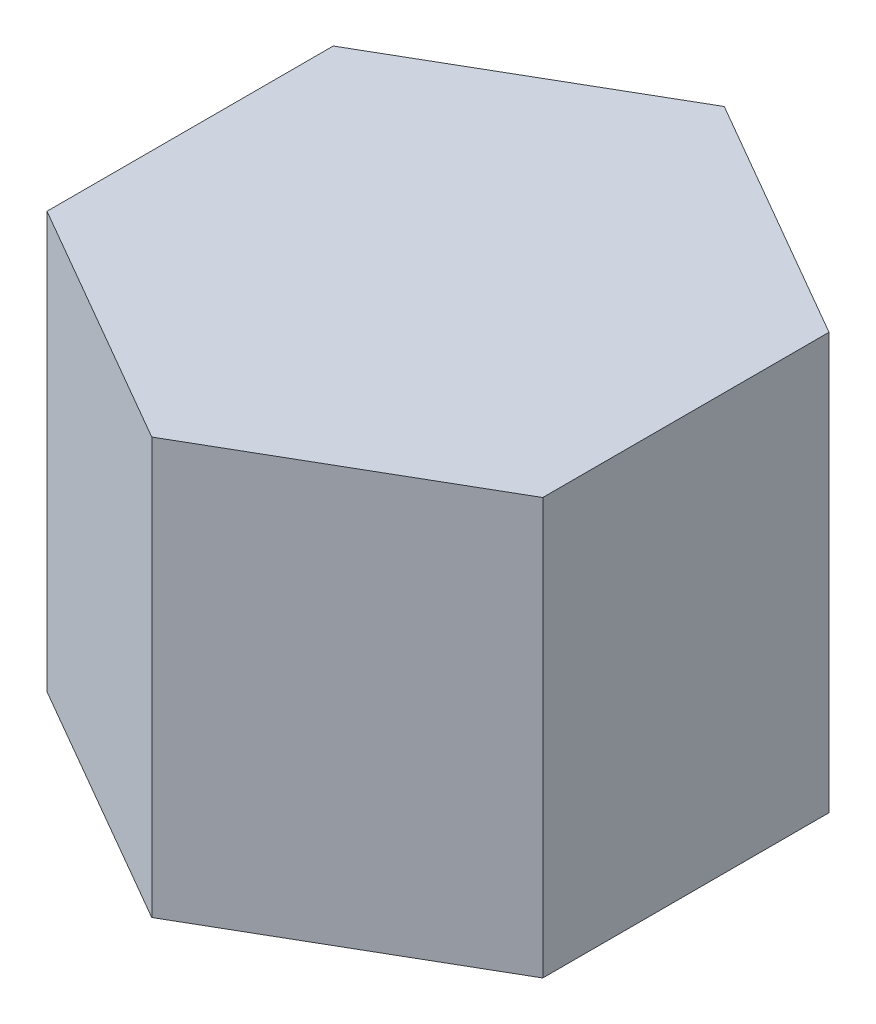
ISO-10303-21;
HEADER;
FILE_DESCRIPTION(('STEP AP214'),'2;1');
FILE_NAME('part.step','',(''),(''),'','','');
FILE_SCHEMA(('AUTOMOTIVE_DESIGN { 1 0 10303 214 1 1 1 1 }'));
ENDSEC;
DATA;
#1=APPLICATION_CONTEXT('core data for automotive mechanical design processes');
#2=APPLICATION_PROTOCOL_DEFINITION('international standard','automotive_design',2000,#1);
#3=PRODUCT_CONTEXT('',#1,'mechanical');
#4=PRODUCT('Part','Part','',(#3));
#5=PRODUCT_RELATED_PRODUCT_CATEGORY('part','',(#4));
#6=PRODUCT_DEFINITION_FORMATION('','',#4);
#7=PRODUCT_DEFINITION_CONTEXT('part definition',#1,'design');
#8=PRODUCT_DEFINITION('design','',#6,#7);
#9=PRODUCT_DEFINITION_SHAPE('','',#8);
#10=(LENGTH_UNIT() NAMED_UNIT(*) SI_UNIT(.MILLI.,.METRE.));
#11=(NAMED_UNIT(*) PLANE_ANGLE_UNIT() SI_UNIT($,.RADIAN.));
#12=(NAMED_UNIT(*) SI_UNIT($,.STERADIAN.) SOLID_ANGLE_UNIT());
#13=UNCERTAINTY_MEASURE_WITH_UNIT(LENGTH_MEASURE(1.E-05),#10,'distance_accuracy_value','');
#14=(GEOMETRIC_REPRESENTATION_CONTEXT(3) GLOBAL_UNCERTAINTY_ASSIGNED_CONTEXT((#13)) GLOBAL_UNIT_ASSIGNED_CONTEXT((#10,
#11,#12)) REPRESENTATION_CONTEXT('',''));
#15=CARTESIAN_POINT('',(0.,0.,0.));
#16=DIRECTION('',(0.,0.,1.));
#17=DIRECTION('',(1.,0.,0.));
#18=AXIS2_PLACEMENT_3D('',#15,#16,#17);
#19=CARTESIAN_POINT('',(208.339551417382,-147.556598747966,293.414022028063));
#20=DIRECTION('',(-0.500000000000028,0.,-0.866025403784422));
#21=DIRECTION('',(-0.866025403784423,0.,0.500000000000028));
#22=AXIS2_PLACEMENT_3D('',#19,#20,#21);
#23=PLANE('',#22);
#24=CARTESIAN_POINT('',(208.642660308706,-147.047793579175,293.239022028063));
#25=DIRECTION('',(-0.866025403784422,0.,0.500000000000028));
#26=VECTOR('',#25,1.);
#27=LINE('',#24,#26);
#28=CARTESIAN_POINT('',(208.642660308706,-147.047793579175,293.239022028063));
#29=VERTEX_POINT('',#28);
#30=CARTESIAN_POINT('',(208.339551417382,-147.047793579175,293.414022028063));
#31=VERTEX_POINT('',#30);
#32=EDGE_CURVE('E170',#29,#31,#27,.T.);
#33=ORIENTED_EDGE('',*,*,#32,.T.);
#34=CARTESIAN_POINT('',(208.339551417382,-147.556598747966,293.414022028063));
#35=DIRECTION('',(0.,1.,0.));
#36=VECTOR('',#35,1.);
#37=LINE('',#34,#36);
#38=CARTESIAN_POINT('',(208.339551417382,-147.556598747966,293.414022028063));
#39=VERTEX_POINT('',#38);
#40=EDGE_CURVE('E35',#39,#31,#37,.T.);
#41=ORIENTED_EDGE('',*,*,#40,.F.);
#42=CARTESIAN_POINT('',(208.642660308706,-147.556598747966,293.239022028063));
#43=DIRECTION('',(-0.866025403784422,0.,0.500000000000028));
#44=VECTOR('',#43,1.);
#45=LINE('',#42,#44);
#46=CARTESIAN_POINT('',(208.642660308706,-147.556598747966,293.239022028063));
#47=VERTEX_POINT('',#46);
#48=EDGE_CURVE('E159',#47,#39,#45,.T.);
#49=ORIENTED_EDGE('',*,*,#48,.F.);
#50=CARTESIAN_POINT('',(208.642660308706,-147.556598747966,293.239022028063));
#51=DIRECTION('',(0.,1.,0.));
#52=VECTOR('',#51,1.);
#53=LINE('',#50,#52);
#54=EDGE_CURVE('E10',#47,#29,#53,.T.);
#55=ORIENTED_EDGE('',*,*,#54,.T.);
#56=EDGE_LOOP('',(#33,#41,#49,#55));
#57=FACE_BOUND('',#56,.T.);
#58=ADVANCED_FACE('F16',(#57),#23,.F.);
#59=CARTESIAN_POINT('',(208.642660308706,-147.556598747966,291.594471220494));
#60=DIRECTION('',(-1.,0.,0.));
#61=DIRECTION('',(0.,-1.,0.));
#62=AXIS2_PLACEMENT_3D('',#59,#60,#61);
#63=PLANE('',#62);
#64=CARTESIAN_POINT('',(208.642660308706,-147.047793579175,292.889022028063));
#65=DIRECTION('',(0.,0.,1.));
#66=VECTOR('',#65,1.);
#67=LINE('',#64,#66);
#68=CARTESIAN_POINT('',(208.642660308706,-147.047793579175,292.889022028063));
#69=VERTEX_POINT('',#68);
#70=EDGE_CURVE('E167',#69,#29,#67,.T.);
#71=ORIENTED_EDGE('',*,*,#70,.T.);
#72=ORIENTED_EDGE('',*,*,#54,.F.);
#73=CARTESIAN_POINT('',(208.642660308706,-147.556598747966,292.889022028063));
#74=DIRECTION('',(0.,0.,1.));
#75=VECTOR('',#74,1.);
#76=LINE('',#73,#75);
#77=CARTESIAN_POINT('',(208.642660308706,-147.556598747966,292.889022028063));
#78=VERTEX_POINT('',#77);
#79=EDGE_CURVE('E156',#78,#47,#76,.T.);
#80=ORIENTED_EDGE('',*,*,#79,.F.);
#81=CARTESIAN_POINT('',(208.642660308706,-147.556598747966,292.889022028063));
#82=DIRECTION('',(0.,1.,0.));
#83=VECTOR('',#82,1.);
#84=LINE('',#81,#83);
#85=EDGE_CURVE('E27',#78,#69,#84,.T.);
#86=ORIENTED_EDGE('',*,*,#85,.T.);
#87=EDGE_LOOP('',(#71,#72,#80,#86));
#88=FACE_BOUND('',#87,.T.);
#89=ADVANCED_FACE('F189',(#88),#63,.F.);
#90=CARTESIAN_POINT('',(208.642660308706,-147.556598747966,292.889022028063));
#91=DIRECTION('',(-0.500000000000062,0.,0.866025403784403));
#92=DIRECTION('',(0.866025403784403,0.,0.500000000000062));
#93=AXIS2_PLACEMENT_3D('',#90,#91,#92);
#94=PLANE('',#93);
#95=CARTESIAN_POINT('',(208.339551417382,-147.047793579175,292.714022028063));
#96=DIRECTION('',(0.866025403784403,0.,0.500000000000062));
#97=VECTOR('',#96,1.);
#98=LINE('',#95,#97);
#99=CARTESIAN_POINT('',(208.339551417382,-147.047793579175,292.714022028063));
#100=VERTEX_POINT('',#99);
#101=EDGE_CURVE('E163',#100,#69,#98,.T.);
#102=ORIENTED_EDGE('',*,*,#101,.T.);
#103=ORIENTED_EDGE('',*,*,#85,.F.);
#104=CARTESIAN_POINT('',(208.339551417382,-147.556598747966,292.714022028063));
#105=DIRECTION('',(0.866025403784403,0.,0.500000000000062));
#106=VECTOR('',#105,1.);
#107=LINE('',#104,#106);
#108=CARTESIAN_POINT('',(208.339551417382,-147.556598747966,292.714022028063));
#109=VERTEX_POINT('',#108);
#110=EDGE_CURVE('E106',#109,#78,#107,.T.);
#111=ORIENTED_EDGE('',*,*,#110,.F.);
#112=CARTESIAN_POINT('',(208.339551417382,-147.556598747966,292.714022028063));
#113=DIRECTION('',(0.,1.,0.));
#114=VECTOR('',#113,1.);
#115=LINE('',#112,#114);
#116=EDGE_CURVE('E94',#109,#100,#115,.T.);
#117=ORIENTED_EDGE('',*,*,#116,.T.);
#118=EDGE_LOOP('',(#102,#103,#111,#117));
#119=FACE_BOUND('',#118,.T.);
#120=ADVANCED_FACE('F198',(#119),#94,.F.);
#121=CARTESIAN_POINT('',(208.339551417382,-147.556598747966,292.714022028063));
#122=DIRECTION('',(0.499999999999943,0.,0.866025403784471));
#123=DIRECTION('',(0.866025403784471,0.,-0.499999999999943));
#124=AXIS2_PLACEMENT_3D('',#121,#122,#123);
#125=PLANE('',#124);
#126=CARTESIAN_POINT('',(208.036442526057,-147.047793579175,292.889022028063));
#127=DIRECTION('',(0.866025403784471,0.,-0.499999999999943));
#128=VECTOR('',#127,1.);
#129=LINE('',#126,#128);
#130=CARTESIAN_POINT('',(208.036442526057,-147.047793579175,292.889022028063));
#131=VERTEX_POINT('',#130);
#132=EDGE_CURVE('E162',#131,#100,#129,.T.);
#133=ORIENTED_EDGE('',*,*,#132,.T.);
#134=ORIENTED_EDGE('',*,*,#116,.F.);
#135=CARTESIAN_POINT('',(208.036442526057,-147.556598747966,292.889022028063));
#136=DIRECTION('',(0.866025403784471,0.,-0.499999999999943));
#137=VECTOR('',#136,1.);
#138=LINE('',#135,#137);
#139=CARTESIAN_POINT('',(208.036442526057,-147.556598747966,292.889022028063));
#140=VERTEX_POINT('',#139);
#141=EDGE_CURVE('E98',#140,#109,#138,.T.);
#142=ORIENTED_EDGE('',*,*,#141,.F.);
#143=CARTESIAN_POINT('',(208.036442526057,-147.556598747966,292.889022028063));
#144=DIRECTION('',(0.,1.,0.));
#145=VECTOR('',#144,1.);
#146=LINE('',#143,#145);
#147=EDGE_CURVE('E79',#140,#131,#146,.T.);
#148=ORIENTED_EDGE('',*,*,#147,.T.);
#149=EDGE_LOOP('',(#133,#134,#142,#148));
#150=FACE_BOUND('',#149,.T.);
#151=ADVANCED_FACE('F100',(#150),#125,.F.);
#152=CARTESIAN_POINT('',(208.036442526057,-147.556598747966,291.594471220494));
#153=DIRECTION('',(1.,0.,0.));
#154=DIRECTION('',(0.,1.,0.));
#155=AXIS2_PLACEMENT_3D('',#152,#153,#154);
#156=PLANE('',#155);
#157=CARTESIAN_POINT('',(208.036442526057,-147.047793579175,293.239022028063));
#158=DIRECTION('',(0.,0.,-1.));
#159=VECTOR('',#158,1.);
#160=LINE('',#157,#159);
#161=CARTESIAN_POINT('',(208.036442526057,-147.047793579175,293.239022028063));
#162=VERTEX_POINT('',#161);
#163=EDGE_CURVE('E88',#162,#131,#160,.T.);
#164=ORIENTED_EDGE('',*,*,#163,.T.);
#165=ORIENTED_EDGE('',*,*,#147,.F.);
#166=CARTESIAN_POINT('',(208.036442526057,-147.556598747966,293.239022028063));
#167=DIRECTION('',(0.,0.,-1.));
#168=VECTOR('',#167,1.);
#169=LINE('',#166,#168);
#170=CARTESIAN_POINT('',(208.036442526057,-147.556598747966,293.239022028063));
#171=VERTEX_POINT('',#170);
#172=EDGE_CURVE('E84',#171,#140,#169,.T.);
#173=ORIENTED_EDGE('',*,*,#172,.F.);
#174=CARTESIAN_POINT('',(208.036442526057,-147.556598747966,293.239022028063));
#175=DIRECTION('',(0.,1.,0.));
#176=VECTOR('',#175,1.);
#177=LINE('',#174,#176);
#178=EDGE_CURVE('E58',#171,#162,#177,.T.);
#179=ORIENTED_EDGE('',*,*,#178,.T.);
#180=EDGE_LOOP('',(#164,#165,#173,#179));
#181=FACE_BOUND('',#180,.T.);
#182=ADVANCED_FACE('F82',(#181),#156,.F.);
#183=CARTESIAN_POINT('',(208.036442526057,-147.556598747966,293.239022028063));
#184=DIRECTION('',(0.500000000000062,0.,-0.866025403784403));
#185=DIRECTION('',(-0.866025403784403,0.,-0.500000000000062));
#186=AXIS2_PLACEMENT_3D('',#183,#184,#185);
#187=PLANE('',#186);
#188=CARTESIAN_POINT('',(208.339551417382,-147.047793579175,293.414022028063));
#189=DIRECTION('',(-0.866025403784403,0.,-0.500000000000062));
#190=VECTOR('',#189,1.);
#191=LINE('',#188,#190);
#192=EDGE_CURVE('E160',#31,#162,#191,.T.);
#193=ORIENTED_EDGE('',*,*,#192,.T.);
#194=ORIENTED_EDGE('',*,*,#178,.F.);
#195=CARTESIAN_POINT('',(208.339551417382,-147.556598747966,293.414022028063));
#196=DIRECTION('',(-0.866025403784403,0.,-0.500000000000062));
#197=VECTOR('',#196,1.);
#198=LINE('',#195,#197);
#199=EDGE_CURVE('E112',#39,#171,#198,.T.);
#200=ORIENTED_EDGE('',*,*,#199,.F.);
#201=ORIENTED_EDGE('',*,*,#40,.T.);
#202=EDGE_LOOP('',(#193,#194,#200,#201));
#203=FACE_BOUND('',#202,.T.);
#204=ADVANCED_FACE('F131',(#203),#187,.F.);
#205=CARTESIAN_POINT('',(206.491105863044,-147.556598747966,291.594471220494));
#206=DIRECTION('',(0.,1.,0.));
#207=DIRECTION('',(-1.,0.,0.));
#208=AXIS2_PLACEMENT_3D('',#205,#206,#207);
#209=PLANE('',#208);
#210=ORIENTED_EDGE('',*,*,#48,.T.);
#211=ORIENTED_EDGE('',*,*,#199,.T.);
#212=ORIENTED_EDGE('',*,*,#172,.T.);
#213=ORIENTED_EDGE('',*,*,#141,.T.);
#214=ORIENTED_EDGE('',*,*,#110,.T.);
#215=ORIENTED_EDGE('',*,*,#79,.T.);
#216=EDGE_LOOP('',(#210,#211,#212,#213,#214,#215));
#217=FACE_BOUND('',#216,.T.);
#218=ADVANCED_FACE('F111',(#217),#209,.F.);
#219=CARTESIAN_POINT('',(206.491105863044,-147.047793579175,291.594471220494));
#220=DIRECTION('',(0.,1.,0.));
#221=DIRECTION('',(-1.,0.,0.));
#222=AXIS2_PLACEMENT_3D('',#219,#220,#221);
#223=PLANE('',#222);
#224=ORIENTED_EDGE('',*,*,#32,.F.);
#225=ORIENTED_EDGE('',*,*,#70,.F.);
#226=ORIENTED_EDGE('',*,*,#101,.F.);
#227=ORIENTED_EDGE('',*,*,#132,.F.);
#228=ORIENTED_EDGE('',*,*,#163,.F.);
#229=ORIENTED_EDGE('',*,*,#192,.F.);
#230=EDGE_LOOP('',(#224,#225,#226,#227,#228,#229));
#231=FACE_BOUND('',#230,.T.);
#232=ADVANCED_FACE('F130',(#231),#223,.T.);
#233=CLOSED_SHELL('',(#58,#89,#120,#151,#182,#204,#218,#232));
#234=MANIFOLD_SOLID_BREP('B1',#233);
#235=ADVANCED_BREP_SHAPE_REPRESENTATION('',(#18,#234),#14);
#236=SHAPE_DEFINITION_REPRESENTATION(#9,#235);
ENDSEC;
END-ISO-10303-21;
